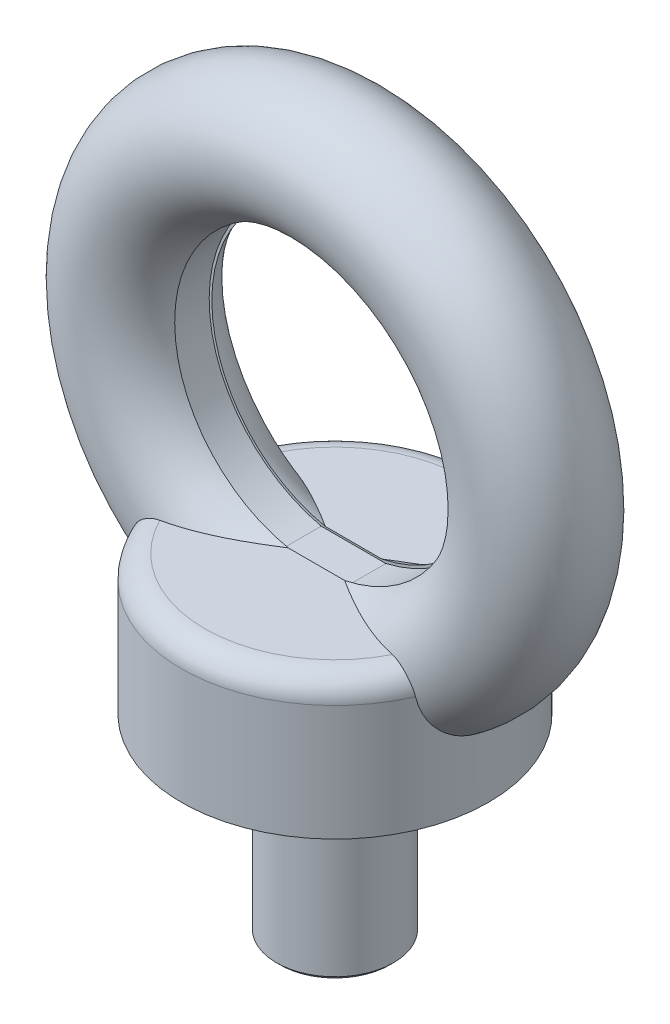
ISO-10303-21;
HEADER;
FILE_DESCRIPTION(('STEP AP214'),'2;1');
FILE_NAME('part.step','',(''),(''),'','','');
FILE_SCHEMA(('AUTOMOTIVE_DESIGN { 1 0 10303 214 1 1 1 1 }'));
ENDSEC;
DATA;
#1=APPLICATION_CONTEXT('core data for automotive mechanical design processes');
#2=APPLICATION_PROTOCOL_DEFINITION('international standard','automotive_design',2000,#1);
#3=PRODUCT_CONTEXT('',#1,'mechanical');
#4=PRODUCT('Part','Part','',(#3));
#5=PRODUCT_RELATED_PRODUCT_CATEGORY('part','',(#4));
#6=PRODUCT_DEFINITION_FORMATION('','',#4);
#7=PRODUCT_DEFINITION_CONTEXT('part definition',#1,'design');
#8=PRODUCT_DEFINITION('design','',#6,#7);
#9=PRODUCT_DEFINITION_SHAPE('','',#8);
#10=(LENGTH_UNIT() NAMED_UNIT(*) SI_UNIT(.MILLI.,.METRE.));
#11=(NAMED_UNIT(*) PLANE_ANGLE_UNIT() SI_UNIT($,.RADIAN.));
#12=(NAMED_UNIT(*) SI_UNIT($,.STERADIAN.) SOLID_ANGLE_UNIT());
#13=UNCERTAINTY_MEASURE_WITH_UNIT(LENGTH_MEASURE(1.E-05),#10,'distance_accuracy_value','');
#14=(GEOMETRIC_REPRESENTATION_CONTEXT(3) GLOBAL_UNCERTAINTY_ASSIGNED_CONTEXT((#13)) GLOBAL_UNIT_ASSIGNED_CONTEXT((#10,
#11,#12)) REPRESENTATION_CONTEXT('',''));
#15=CARTESIAN_POINT('',(0.,0.,0.));
#16=DIRECTION('',(0.,0.,1.));
#17=DIRECTION('',(1.,0.,0.));
#18=AXIS2_PLACEMENT_3D('',#15,#16,#17);
#19=CARTESIAN_POINT('',(0.,-32.,0.));
#20=DIRECTION('',(0.,1.,0.));
#21=DIRECTION('',(0.,0.,1.));
#22=AXIS2_PLACEMENT_3D('',#19,#20,#21);
#23=PLANE('',#22);
#24=CARTESIAN_POINT('',(0.,-32.000000000096,0.));
#25=DIRECTION('',(0.,1.,0.));
#26=DIRECTION('',(0.,0.,1.));
#27=AXIS2_PLACEMENT_3D('',#24,#25,#26);
#28=CIRCLE('',#27,3.75000000008185);
#29=CARTESIAN_POINT('',(3.75000000008185,-32.000000000096,0.));
#30=VERTEX_POINT('',#29);
#31=EDGE_CURVE('E18',#30,#30,#28,.T.);
#32=ORIENTED_EDGE('',*,*,#31,.F.);
#33=EDGE_LOOP('',(#32));
#34=FACE_BOUND('',#33,.T.);
#35=ADVANCED_FACE('F15',(#34),#23,.F.);
#36=CARTESIAN_POINT('',(0.,-31.7499999999313,0.));
#37=DIRECTION('',(0.,1.,0.));
#38=DIRECTION('',(0.,0.,1.));
#39=AXIS2_PLACEMENT_3D('',#36,#37,#38);
#40=CONICAL_SURFACE('',#39,3.99999999979173,0.785398162487954);
#41=CARTESIAN_POINT('',(0.,-31.75,0.));
#42=DIRECTION('',(0.,-1.,0.));
#43=DIRECTION('',(0.,0.,-1.));
#44=AXIS2_PLACEMENT_3D('',#41,#42,#43);
#45=CIRCLE('',#44,4.);
#46=CARTESIAN_POINT('',(3.99999999992429,-31.7499999999372,0.));
#47=VERTEX_POINT('',#46);
#48=EDGE_CURVE('E34',#47,#47,#45,.F.);
#49=ORIENTED_EDGE('',*,*,#48,.F.);
#50=EDGE_LOOP('',(#49));
#51=FACE_BOUND('',#50,.T.);
#52=ORIENTED_EDGE('',*,*,#31,.T.);
#53=EDGE_LOOP('',(#52));
#54=FACE_BOUND('',#53,.T.);
#55=ADVANCED_FACE('F297',(#51,#54),#40,.T.);
#56=CARTESIAN_POINT('',(0.,-19.,0.));
#57=DIRECTION('',(0.,-1.,0.));
#58=DIRECTION('',(0.,0.,-1.));
#59=AXIS2_PLACEMENT_3D('',#56,#57,#58);
#60=CYLINDRICAL_SURFACE('',#59,4.);
#61=ORIENTED_EDGE('',*,*,#48,.T.);
#62=EDGE_LOOP('',(#61));
#63=FACE_BOUND('',#62,.T.);
#64=CARTESIAN_POINT('',(0.,-19.,0.));
#65=DIRECTION('',(0.,-1.,0.));
#66=DIRECTION('',(0.,0.,-1.));
#67=AXIS2_PLACEMENT_3D('',#64,#65,#66);
#68=CIRCLE('',#67,4.);
#69=CARTESIAN_POINT('',(4.,-19.,0.));
#70=VERTEX_POINT('',#69);
#71=EDGE_CURVE('E95',#70,#70,#68,.F.);
#72=ORIENTED_EDGE('',*,*,#71,.F.);
#73=EDGE_LOOP('',(#72));
#74=FACE_BOUND('',#73,.T.);
#75=ADVANCED_FACE('F299',(#63,#74),#60,.T.);
#76=CARTESIAN_POINT('',(0.,0.,0.));
#77=DIRECTION('',(0.,0.,-1.));
#78=DIRECTION('',(-1.,0.,0.));
#79=AXIS2_PLACEMENT_3D('',#76,#77,#78);
#80=CYLINDRICAL_SURFACE('',#79,9.875);
#81=DIRECTION('',(0.,0.,-1.));
#82=VECTOR('',#81,1.);
#83=CARTESIAN_POINT('',(2.20794021658196,-9.62500000000001,0.));
#84=LINE('',#83,#82);
#85=CARTESIAN_POINT('',(2.20794021658194,-9.62500000000001,-1.27));
#86=VERTEX_POINT('',#85);
#87=CARTESIAN_POINT('',(2.20794021658194,-9.62500000000001,1.27));
#88=VERTEX_POINT('',#87);
#89=EDGE_CURVE('E96',#86,#88,#84,.F.);
#90=ORIENTED_EDGE('',*,*,#89,.T.);
#91=CARTESIAN_POINT('',(0.,0.,1.27));
#92=DIRECTION('',(0.,0.,-1.));
#93=DIRECTION('',(-1.,0.,0.));
#94=AXIS2_PLACEMENT_3D('',#91,#92,#93);
#95=CIRCLE('',#94,9.875);
#96=CARTESIAN_POINT('',(-2.20794021658194,-9.62500000000001,1.27));
#97=VERTEX_POINT('',#96);
#98=EDGE_CURVE('E98',#88,#97,#95,.F.);
#99=ORIENTED_EDGE('',*,*,#98,.T.);
#100=DIRECTION('',(0.,0.,-1.));
#101=VECTOR('',#100,1.);
#102=CARTESIAN_POINT('',(-2.20794021658196,-9.62500000000001,0.));
#103=LINE('',#102,#101);
#104=CARTESIAN_POINT('',(-2.20794021658194,-9.62500000000001,-1.27));
#105=VERTEX_POINT('',#104);
#106=EDGE_CURVE('E84',#97,#105,#103,.T.);
#107=ORIENTED_EDGE('',*,*,#106,.T.);
#108=CARTESIAN_POINT('',(0.,0.,-1.27));
#109=DIRECTION('',(0.,0.,-1.));
#110=DIRECTION('',(-1.,0.,0.));
#111=AXIS2_PLACEMENT_3D('',#108,#109,#110);
#112=CIRCLE('',#111,9.875);
#113=EDGE_CURVE('E101',#86,#105,#112,.F.);
#114=ORIENTED_EDGE('',*,*,#113,.F.);
#115=EDGE_LOOP('',(#90,#99,#107,#114));
#116=FACE_BOUND('',#115,.T.);
#117=ADVANCED_FACE('F99',(#116),#80,.F.);
#118=CARTESIAN_POINT('',(-2.20794021658196,-9.62500000000001,0.));
#119=DIRECTION('',(0.,-1.,0.));
#120=DIRECTION('',(0.,0.,-1.));
#121=AXIS2_PLACEMENT_3D('',#118,#119,#120);
#122=PLANE('',#121);
#123=ORIENTED_EDGE('',*,*,#106,.F.);
#124=DIRECTION('',(1.,0.,0.));
#125=VECTOR('',#124,1.);
#126=CARTESIAN_POINT('',(0.,-9.62500000000001,1.27));
#127=LINE('',#126,#125);
#128=EDGE_CURVE('E89',#97,#88,#127,.T.);
#129=ORIENTED_EDGE('',*,*,#128,.T.);
#130=ORIENTED_EDGE('',*,*,#89,.F.);
#131=DIRECTION('',(1.,0.,0.));
#132=VECTOR('',#131,1.);
#133=CARTESIAN_POINT('',(0.,-9.62500000000001,-1.27));
#134=LINE('',#133,#132);
#135=EDGE_CURVE('E92',#105,#86,#134,.T.);
#136=ORIENTED_EDGE('',*,*,#135,.F.);
#137=EDGE_LOOP('',(#123,#129,#130,#136));
#138=FACE_BOUND('',#137,.T.);
#139=ADVANCED_FACE('F86',(#138),#122,.F.);
#140=CARTESIAN_POINT('',(0.,-19.,0.));
#141=DIRECTION('',(0.,-1.,0.));
#142=DIRECTION('',(0.,0.,-1.));
#143=AXIS2_PLACEMENT_3D('',#140,#141,#142);
#144=PLANE('',#143);
#145=ORIENTED_EDGE('',*,*,#71,.T.);
#146=EDGE_LOOP('',(#145));
#147=FACE_BOUND('',#146,.T.);
#148=CARTESIAN_POINT('',(0.,-19.,0.));
#149=DIRECTION('',(0.,-1.,0.));
#150=DIRECTION('',(0.,0.,-1.));
#151=AXIS2_PLACEMENT_3D('',#148,#149,#150);
#152=CIRCLE('',#151,10.5);
#153=CARTESIAN_POINT('',(-10.5,-19.,0.));
#154=VERTEX_POINT('',#153);
#155=EDGE_CURVE('E225',#154,#154,#152,.F.);
#156=ORIENTED_EDGE('',*,*,#155,.F.);
#157=EDGE_LOOP('',(#156));
#158=FACE_BOUND('',#157,.T.);
#159=ADVANCED_FACE('F312',(#147,#158),#144,.T.);
#160=CARTESIAN_POINT('',(0.,-0.877040002481511,1.27));
#161=DIRECTION('',(0.,0.,1.));
#162=DIRECTION('',(1.,0.,0.));
#163=AXIS2_PLACEMENT_3D('',#160,#161,#162);
#164=PLANE('',#163);
#165=CARTESIAN_POINT('',(0.,0.,1.27));
#166=DIRECTION('',(0.,0.,1.));
#167=DIRECTION('',(1.,0.,0.));
#168=AXIS2_PLACEMENT_3D('',#165,#166,#167);
#169=CIRCLE('',#168,9.69418935353239);
#170=CARTESIAN_POINT('',(-1.93062353183149,-9.5,1.26999999996053));
#171=VERTEX_POINT('',#170);
#172=CARTESIAN_POINT('',(1.93062353183149,-9.5,1.26999999996053));
#173=VERTEX_POINT('',#172);
#174=EDGE_CURVE('E210',#171,#173,#169,.F.);
#175=ORIENTED_EDGE('',*,*,#174,.F.);
#176=DIRECTION('',(1.,0.,0.));
#177=VECTOR('',#176,1.);
#178=CARTESIAN_POINT('',(0.,-9.5,1.26999999992106));
#179=LINE('',#178,#177);
#180=EDGE_CURVE('E147',#171,#173,#179,.T.);
#181=ORIENTED_EDGE('',*,*,#180,.T.);
#182=EDGE_LOOP('',(#175,#181));
#183=FACE_BOUND('',#182,.T.);
#184=ORIENTED_EDGE('',*,*,#128,.F.);
#185=ORIENTED_EDGE('',*,*,#98,.F.);
#186=EDGE_LOOP('',(#184,#185));
#187=FACE_BOUND('',#186,.T.);
#188=ADVANCED_FACE('F103',(#183,#187),#164,.F.);
#189=CARTESIAN_POINT('',(0.,-0.877040002481511,-1.27));
#190=DIRECTION('',(0.,0.,1.));
#191=DIRECTION('',(1.,0.,0.));
#192=AXIS2_PLACEMENT_3D('',#189,#190,#191);
#193=PLANE('',#192);
#194=DIRECTION('',(1.,0.,0.));
#195=VECTOR('',#194,1.);
#196=CARTESIAN_POINT('',(0.,-9.5,-1.26999999992106));
#197=LINE('',#196,#195);
#198=CARTESIAN_POINT('',(1.93062353183149,-9.5,-1.26999999996053));
#199=VERTEX_POINT('',#198);
#200=CARTESIAN_POINT('',(-1.93062353183149,-9.5,-1.26999999996053));
#201=VERTEX_POINT('',#200);
#202=EDGE_CURVE('E232',#199,#201,#197,.F.);
#203=ORIENTED_EDGE('',*,*,#202,.T.);
#204=CARTESIAN_POINT('',(0.,0.,-1.27));
#205=DIRECTION('',(0.,0.,1.));
#206=DIRECTION('',(1.,0.,0.));
#207=AXIS2_PLACEMENT_3D('',#204,#205,#206);
#208=CIRCLE('',#207,9.69418935353239);
#209=EDGE_CURVE('E254',#199,#201,#208,.T.);
#210=ORIENTED_EDGE('',*,*,#209,.F.);
#211=EDGE_LOOP('',(#203,#210));
#212=FACE_BOUND('',#211,.T.);
#213=ORIENTED_EDGE('',*,*,#113,.T.);
#214=ORIENTED_EDGE('',*,*,#135,.T.);
#215=EDGE_LOOP('',(#213,#214));
#216=FACE_BOUND('',#215,.T.);
#217=ADVANCED_FACE('F317',(#212,#216),#193,.T.);
#218=CARTESIAN_POINT('',(0.,-9.5,0.));
#219=DIRECTION('',(0.,-1.,0.));
#220=DIRECTION('',(0.,0.,-1.));
#221=AXIS2_PLACEMENT_3D('',#218,#219,#220);
#222=PLANE('',#221);
#223=CARTESIAN_POINT('',(7.9513487411079,-9.5,-4.02600415390766));
#224=CARTESIAN_POINT('',(7.77426963140982,-9.5,-3.98756247792273));
#225=CARTESIAN_POINT('',(7.59817873115079,-9.5,-3.94473743581779));
#226=CARTESIAN_POINT('',(7.2485593516621,-9.5,-3.85120167224825));
#227=CARTESIAN_POINT('',(7.07502566357417,-9.5,-3.80051047022335));
#228=CARTESIAN_POINT('',(6.73042839329768,-9.5,-3.69198742421505));
#229=CARTESIAN_POINT('',(6.55936231907256,-9.5,-3.63416344385591));
#230=CARTESIAN_POINT('',(6.21960369083263,-9.5,-3.51204488138265));
#231=CARTESIAN_POINT('',(6.05091064210426,-9.5,-3.44775167142103));
#232=CARTESIAN_POINT('',(5.71724888491216,-9.5,-3.31389856708));
#233=CARTESIAN_POINT('',(5.55226093712393,-9.5,-3.24438646647425));
#234=CARTESIAN_POINT('',(5.22446991521825,-9.5,-3.10020663315823));
#235=CARTESIAN_POINT('',(5.06166786963588,-9.5,-3.02553656845705));
#236=CARTESIAN_POINT('',(4.73818909903167,-9.5,-2.87161188912956));
#237=CARTESIAN_POINT('',(4.57751305461333,-9.5,-2.79235584801867));
#238=CARTESIAN_POINT('',(4.25823165345901,-9.5,-2.62981787604122));
#239=CARTESIAN_POINT('',(4.09962612346811,-9.5,-2.54653628479975));
#240=CARTESIAN_POINT('',(3.59979324213566,-9.5,-2.27690824406194));
#241=CARTESIAN_POINT('',(3.26210494822447,-9.5,-2.08402463555646));
#242=CARTESIAN_POINT('',(2.59225858877623,-9.5,-1.68536225049192));
#243=CARTESIAN_POINT('',(2.26013363862863,-9.5,-1.47952755642758));
#244=CARTESIAN_POINT('',(1.93062353175026,-9.5,-1.2699999998694));
#245=B_SPLINE_CURVE_WITH_KNOTS('',3,(#223,#224,#225,#226,#227,#228,#229,#230,#231,#232,#233,
#234,#235,#236,#237,#238,#239,#240,#241,#242,#243,#244),.UNSPECIFIED.,.F.,.F.,(4,2,2,2,2,2,2,2,
2,2,4),(0.,0.543503322581538,1.08567892465648,1.62726205258377,2.16873054949225,
2.70573469798466,3.24298324337254,3.78039980972253,4.31777111451569,5.48412750308637,
6.65592064750923),.UNSPECIFIED.);
#246=CARTESIAN_POINT('',(7.9513487411079,-9.5,-4.02600415390766));
#247=VERTEX_POINT('',#246);
#248=EDGE_CURVE('E252',#247,#199,#245,.T.);
#249=ORIENTED_EDGE('',*,*,#248,.F.);
#250=CARTESIAN_POINT('',(0.,-9.5,0.));
#251=DIRECTION('',(0.,-1.,0.));
#252=DIRECTION('',(-0.892156941498783,0.,-0.451725571265937));
#253=AXIS2_PLACEMENT_3D('',#250,#251,#252);
#254=CIRCLE('',#253,8.9125);
#255=CARTESIAN_POINT('',(-7.9513487411079,-9.5,-4.02600415390766));
#256=VERTEX_POINT('',#255);
#257=EDGE_CURVE('E230',#256,#247,#254,.T.);
#258=ORIENTED_EDGE('',*,*,#257,.F.);
#259=CARTESIAN_POINT('',(-1.93062353175027,-9.5,-1.2699999998694));
#260=CARTESIAN_POINT('',(-2.08754631197371,-9.5,-1.36980162375454));
#261=CARTESIAN_POINT('',(-2.24503214338724,-9.5,-1.46873243198837));
#262=CARTESIAN_POINT('',(-2.56089186561598,-9.5,-1.66408825502746));
#263=CARTESIAN_POINT('',(-2.71926163896022,-9.5,-1.76051993420801));
#264=CARTESIAN_POINT('',(-3.03713876651275,-9.5,-1.95044848550183));
#265=CARTESIAN_POINT('',(-3.19664154588332,-9.5,-2.04395299261603));
#266=CARTESIAN_POINT('',(-3.51703272276256,-9.5,-2.22758916870737));
#267=CARTESIAN_POINT('',(-3.67791646835831,-9.5,-2.31772893721635));
#268=CARTESIAN_POINT('',(-4.00132317056332,-9.5,-2.49419108926024));
#269=CARTESIAN_POINT('',(-4.16384189511633,-9.5,-2.58052121055377));
#270=CARTESIAN_POINT('',(-4.49077964156292,-9.5,-2.74890577179906));
#271=CARTESIAN_POINT('',(-4.65519548633682,-9.5,-2.83096636534168));
#272=CARTESIAN_POINT('',(-4.98675598422368,-9.5,-2.99060051162638));
#273=CARTESIAN_POINT('',(-5.15390691106692,-9.5,-3.06816106947477));
#274=CARTESIAN_POINT('',(-5.49061288831372,-9.5,-3.21794722186607));
#275=CARTESIAN_POINT('',(-5.66016822132656,-9.5,-3.29017218297319));
#276=CARTESIAN_POINT('',(-6.00189552402462,-9.5,-3.42869645935955));
#277=CARTESIAN_POINT('',(-6.17407002441795,-9.5,-3.49498955317415));
#278=CARTESIAN_POINT('',(-6.52126391164362,-9.5,-3.62101149929799));
#279=CARTESIAN_POINT('',(-6.6962889624734,-9.5,-3.68072479739974));
#280=CARTESIAN_POINT('',(-7.04944414187317,-9.5,-3.79288678858337));
#281=CARTESIAN_POINT('',(-7.22758394416269,-9.5,-3.84530522261255));
#282=CARTESIAN_POINT('',(-7.58723841641442,-9.5,-3.94207199833537));
#283=CARTESIAN_POINT('',(-7.7687672682436,-9.5,-3.98636749070313));
#284=CARTESIAN_POINT('',(-7.95134874110791,-9.5,-4.02600415390766));
#285=B_SPLINE_CURVE_WITH_KNOTS('',3,(#259,#260,#261,#262,#263,#264,#265,#266,#267,#268,#269,
#270,#271,#272,#273,#274,#275,#276,#277,#278,#279,#280,#281,#282,#283,#284),.UNSPECIFIED.,.F.,
.F.,(4,2,2,2,2,2,2,2,2,2,2,2,4),(0.,0.557921096010694,1.11415751365786,1.66879603703007,
2.22199975182574,2.77402261536739,3.32522646914338,3.87795003386041,4.43073911217067,
4.98410133279853,5.53874480511595,6.09562441408643,6.65600772441404),.UNSPECIFIED.);
#286=EDGE_CURVE('E175',#201,#256,#285,.T.);
#287=ORIENTED_EDGE('',*,*,#286,.F.);
#288=ORIENTED_EDGE('',*,*,#202,.F.);
#289=EDGE_LOOP('',(#249,#258,#287,#288));
#290=FACE_BOUND('',#289,.T.);
#291=ADVANCED_FACE('F157',(#290),#222,.F.);
#292=CARTESIAN_POINT('',(0.,-11.0875,0.));
#293=DIRECTION('',(0.,-1.,0.));
#294=DIRECTION('',(0.,0.,-1.));
#295=AXIS2_PLACEMENT_3D('',#292,#293,#294);
#296=TOROIDAL_SURFACE('',#295,8.91250000000001,1.5875);
#297=CARTESIAN_POINT('',(9.64807510074433,-11.0874999957977,-4.14302387760408));
#298=CARTESIAN_POINT('',(9.64445769789736,-11.0418561751411,-4.15144402068093));
#299=CARTESIAN_POINT('',(9.63879743001377,-10.9963575091574,-4.15960780416379));
#300=CARTESIAN_POINT('',(9.623550812963,-10.9059118968888,-4.17521023224506));
#301=CARTESIAN_POINT('',(9.61396579385729,-10.8609647690025,-4.18264912144712));
#302=CARTESIAN_POINT('',(9.57960605951506,-10.7274864343238,-4.20353866089209));
#303=CARTESIAN_POINT('',(9.54920984900103,-10.6401213874514,-4.21559989835874));
#304=CARTESIAN_POINT('',(9.47488926181832,-10.4709079494251,-4.23466514671791));
#305=CARTESIAN_POINT('',(9.43097532149524,-10.3890553615963,-4.24167304513094));
#306=CARTESIAN_POINT('',(9.33104345543921,-10.2327538149956,-4.24984626618132));
#307=CARTESIAN_POINT('',(9.2750238662765,-10.1583058757469,-4.25101078535039));
#308=CARTESIAN_POINT('',(9.15117502728964,-10.0174047934862,-4.24716070750764));
#309=CARTESIAN_POINT('',(9.08312666165472,-9.95114748134784,-4.24201858253305));
#310=CARTESIAN_POINT('',(8.93785910412215,-9.83048206460857,-4.22566133372415));
#311=CARTESIAN_POINT('',(8.86063966859108,-9.77607427490421,-4.21444604852555));
#312=CARTESIAN_POINT('',(8.69963115060783,-9.68124473022324,-4.18705528779658));
#313=CARTESIAN_POINT('',(8.61589401662701,-9.64072399082316,-4.17091653611169));
#314=CARTESIAN_POINT('',(8.44345163235096,-9.57448963704373,-4.13527789545852));
#315=CARTESIAN_POINT('',(8.35474961821371,-9.5487664979774,-4.11578017906333));
#316=CARTESIAN_POINT('',(8.2130761256209,-9.52055759010703,-4.08416267050926));
#317=CARTESIAN_POINT('',(8.16100121654907,-9.51284016202147,-4.07244299888052));
#318=CARTESIAN_POINT('',(8.05642555610206,-9.5025625682513,-4.04907000036398));
#319=CARTESIAN_POINT('',(8.0039256978402,-9.49999349893469,-4.03741659375213));
#320=CARTESIAN_POINT('',(7.9513487411079,-9.5,-4.02600415390766));
#321=B_SPLINE_CURVE_WITH_KNOTS('',3,(#297,#298,#299,#300,#301,#302,#303,#304,#305,#306,#307,
#308,#309,#310,#311,#312,#313,#314,#315,#316,#317,#318,#319,#320),.UNSPECIFIED.,.F.,.F.,(4,2,2,
2,2,2,2,2,2,2,2,4),(0.,0.139563490505869,0.279079723343215,0.557516563696675,0.835738974132054,
1.11399963927455,1.39798103428568,1.68196997507263,1.96389040839304,2.24562917597111,
2.4072025006827,2.5684961566141),.UNSPECIFIED.);
#322=CARTESIAN_POINT('',(9.64807510091072,-11.0874999847841,-4.14302387721659));
#323=VERTEX_POINT('',#322);
#324=EDGE_CURVE('E247',#323,#247,#321,.T.);
#325=ORIENTED_EDGE('',*,*,#324,.F.);
#326=CARTESIAN_POINT('',(0.,-11.0874999737705,0.));
#327=DIRECTION('',(0.,-1.,0.));
#328=DIRECTION('',(0.,0.,-1.));
#329=AXIS2_PLACEMENT_3D('',#326,#327,#328);
#330=CIRCLE('',#329,10.5);
#331=CARTESIAN_POINT('',(-9.64807509825387,-11.087499977465,-4.14302388340375));
#332=VERTEX_POINT('',#331);
#333=EDGE_CURVE('E228',#332,#323,#330,.T.);
#334=ORIENTED_EDGE('',*,*,#333,.F.);
#335=CARTESIAN_POINT('',(-7.9513487411079,-9.5,-4.02600415390766));
#336=CARTESIAN_POINT('',(-7.99749082900566,-9.4999926050418,-4.03602012238849));
#337=CARTESIAN_POINT('',(-8.04359041312341,-9.5019725081142,-4.04622507523822));
#338=CARTESIAN_POINT('',(-8.13543048009467,-9.50988853288595,-4.06671202526468));
#339=CARTESIAN_POINT('',(-8.1811709696301,-9.51582458079318,-4.07699402100083));
#340=CARTESIAN_POINT('',(-8.27199063845926,-9.53162932308622,-4.09732784372282));
#341=CARTESIAN_POINT('',(-8.31707023266038,-9.54149543004416,-4.10737981755272));
#342=CARTESIAN_POINT('',(-8.40630899598492,-9.56507737358415,-4.12697394554823));
#343=CARTESIAN_POINT('',(-8.45046819444039,-9.5787930872811,-4.13651611597594));
#344=CARTESIAN_POINT('',(-8.58124125070726,-9.62560010322376,-4.1639900125819));
#345=CARTESIAN_POINT('',(-8.66615176037778,-9.66435148950587,-4.18076940179846));
#346=CARTESIAN_POINT('',(-8.82904001449954,-9.75557458061028,-4.20946357762714));
#347=CARTESIAN_POINT('',(-8.90702073722982,-9.80804035268562,-4.22138046202985));
#348=CARTESIAN_POINT('',(-9.05366838755774,-9.9246009087517,-4.23923000137627));
#349=CARTESIAN_POINT('',(-9.122393841521,-9.98861598285247,-4.24520195129151));
#350=CARTESIAN_POINT('',(-9.24937612762581,-10.1266074888581,-4.25089141130713));
#351=CARTESIAN_POINT('',(-9.30762654896153,-10.2005899727847,-4.25060510434864));
#352=CARTESIAN_POINT('',(-9.41234366539559,-10.3569524102614,-4.24396504503475));
#353=CARTESIAN_POINT('',(-9.45872664031041,-10.4393865725051,-4.23756961477394));
#354=CARTESIAN_POINT('',(-9.53760404347008,-10.6100344489708,-4.21943952584465));
#355=CARTESIAN_POINT('',(-9.57011613971523,-10.6982406448126,-4.2077116988976));
#356=CARTESIAN_POINT('',(-9.60853254114128,-10.8372889927011,-4.18649196797806));
#357=CARTESIAN_POINT('',(-9.61981558887651,-10.8869147193252,-4.17840204948216));
#358=CARTESIAN_POINT('',(-9.63758547663741,-10.9868019132379,-4.16132050776901));
#359=CARTESIAN_POINT('',(-9.6440778622085,-11.0370625767433,-4.15232994086062));
#360=CARTESIAN_POINT('',(-9.64807509958506,-11.0874999811594,-4.14302388030373));
#361=B_SPLINE_CURVE_WITH_KNOTS('',3,(#335,#336,#337,#338,#339,#340,#341,#342,#343,#344,#345,
#346,#347,#348,#349,#350,#351,#352,#353,#354,#355,#356,#357,#358,#359,#360),.UNSPECIFIED.,.F.,
.F.,(4,2,2,2,2,2,2,2,2,2,2,2,4),(0.,0.141605197575412,0.28320775392885,0.42471723726791,
0.566222203930542,0.849228462658154,1.13211249689244,1.41311404899681,1.69428699537243,
1.97739197402879,2.26013526388664,2.41451976391789,2.56872527091634),.UNSPECIFIED.);
#362=EDGE_CURVE('E173',#256,#332,#361,.T.);
#363=ORIENTED_EDGE('',*,*,#362,.F.);
#364=ORIENTED_EDGE('',*,*,#257,.T.);
#365=EDGE_LOOP('',(#325,#334,#363,#364));
#366=FACE_BOUND('',#365,.T.);
#367=ADVANCED_FACE('F153',(#366),#296,.T.);
#368=CARTESIAN_POINT('',(0.,-9.5,0.));
#369=DIRECTION('',(0.,-1.,0.));
#370=DIRECTION('',(0.,0.,-1.));
#371=AXIS2_PLACEMENT_3D('',#368,#369,#370);
#372=CYLINDRICAL_SURFACE('',#371,10.5);
#373=ORIENTED_EDGE('',*,*,#155,.T.);
#374=EDGE_LOOP('',(#373));
#375=FACE_BOUND('',#374,.T.);
#376=CARTESIAN_POINT('',(0.,-11.0874999737705,0.));
#377=DIRECTION('',(0.,-1.,0.));
#378=DIRECTION('',(0.,0.,-1.));
#379=AXIS2_PLACEMENT_3D('',#376,#377,#378);
#380=CIRCLE('',#379,10.5);
#381=CARTESIAN_POINT('',(-9.64807510091072,-11.0874999847841,4.14302387721659));
#382=VERTEX_POINT('',#381);
#383=CARTESIAN_POINT('',(9.64807509825387,-11.087499977465,4.14302388340376));
#384=VERTEX_POINT('',#383);
#385=EDGE_CURVE('E203',#382,#384,#380,.F.);
#386=ORIENTED_EDGE('',*,*,#385,.F.);
#387=CARTESIAN_POINT('',(-9.64807509958506,-11.0874999811594,-4.14302388030373));
#388=CARTESIAN_POINT('',(-9.65461549278002,-11.1701456818462,-4.12778492858993));
#389=CARTESIAN_POINT('',(-9.66189203790399,-11.2524131843892,-4.1107476470517));
#390=CARTESIAN_POINT('',(-9.67791470537175,-11.4160215736431,-4.07288694724268));
#391=CARTESIAN_POINT('',(-9.68666242909872,-11.4973613463676,-4.05205940120544));
#392=CARTESIAN_POINT('',(-9.70561315046534,-11.6587856996774,-4.00645459601666));
#393=CARTESIAN_POINT('',(-9.71581657801865,-11.7388699016719,-3.98167616979474));
#394=CARTESIAN_POINT('',(-9.73765931322789,-11.897714055601,-3.92795566515776));
#395=CARTESIAN_POINT('',(-9.74930297213072,-11.9764691353065,-3.89900092316965));
#396=CARTESIAN_POINT('',(-9.77391332507569,-12.1320695649417,-3.83689110121257));
#397=CARTESIAN_POINT('',(-9.7868795987626,-12.2089155120384,-3.80373735497238));
#398=CARTESIAN_POINT('',(-9.81401408374504,-12.3603932231304,-3.73316962649279));
#399=CARTESIAN_POINT('',(-9.82818216562881,-12.4350252243601,-3.69575610280188));
#400=CARTESIAN_POINT('',(-9.86505488789359,-12.6191454395112,-3.59649178646774));
#401=CARTESIAN_POINT('',(-9.88843372111874,-12.7270380934162,-3.5318961010752));
#402=CARTESIAN_POINT('',(-9.93692332835508,-12.9360395819393,-3.39307450242203));
#403=CARTESIAN_POINT('',(-9.96203432252995,-13.0371475509664,-3.31884736390985));
#404=CARTESIAN_POINT('',(-10.0131346999281,-13.2314056127395,-3.16132412897517));
#405=CARTESIAN_POINT('',(-10.0391219634384,-13.3245732214732,-3.07804896721651));
#406=CARTESIAN_POINT('',(-10.0911654096111,-13.5023861215665,-2.90288158579186));
#407=CARTESIAN_POINT('',(-10.1172215844936,-13.5870323360898,-2.81099030163964));
#408=CARTESIAN_POINT('',(-10.1659903577102,-13.7392405268192,-2.62880832550719));
#409=CARTESIAN_POINT('',(-10.1887790354973,-13.8076641408025,-2.53925575332839));
#410=CARTESIAN_POINT('',(-10.2330868668497,-13.9367122825532,-2.35435161409741));
#411=CARTESIAN_POINT('',(-10.2546055835279,-13.9973341347581,-2.25899807406454));
#412=CARTESIAN_POINT('',(-10.2957915015954,-14.1104758182562,-2.06317494936481));
#413=CARTESIAN_POINT('',(-10.3154580365072,-14.1629927374297,-1.96270354300344));
#414=CARTESIAN_POINT('',(-10.3524179427039,-14.259697893662,-1.75736399789809));
#415=CARTESIAN_POINT('',(-10.3697104210724,-14.3038829993283,-1.6524942241202));
#416=CARTESIAN_POINT('',(-10.40136442891,-14.3834850390364,-1.43982691851832));
#417=CARTESIAN_POINT('',(-10.4157438922876,-14.4189559288201,-1.33205223746092));
#418=CARTESIAN_POINT('',(-10.4413531152915,-14.4813909833035,-1.1136591963968));
#419=CARTESIAN_POINT('',(-10.4525817356154,-14.5083520714117,-1.00303982352981));
#420=CARTESIAN_POINT('',(-10.4716001730296,-14.5536607815102,-0.779826256187441));
#421=CARTESIAN_POINT('',(-10.479391920542,-14.5720132391629,-0.667233207334288));
#422=CARTESIAN_POINT('',(-10.4913586882862,-14.6000843170538,-0.440746442321083));
#423=CARTESIAN_POINT('',(-10.4955324416128,-14.6097999129713,-0.326852284687729));
#424=CARTESIAN_POINT('',(-10.5001965226895,-14.6206523612046,-0.0966673438280923));
#425=CARTESIAN_POINT('',(-10.5006240157567,-14.6216428722058,0.0196316409426587));
#426=CARTESIAN_POINT('',(-10.4976203136457,-14.6146596372669,0.251910405018258));
#427=CARTESIAN_POINT('',(-10.4941890979927,-14.606685843761,0.367890182626075));
#428=CARTESIAN_POINT('',(-10.4835517651736,-14.5817903312691,0.598747432549477));
#429=CARTESIAN_POINT('',(-10.4763444883108,-14.564865863354,0.71362455517631));
#430=CARTESIAN_POINT('',(-10.4583384226846,-14.52211996326,0.941383425919574));
#431=CARTESIAN_POINT('',(-10.4475409115765,-14.4963016959969,1.05426586885327));
#432=CARTESIAN_POINT('',(-10.422586288463,-14.4357401792977,1.27764124666855));
#433=CARTESIAN_POINT('',(-10.4084180864988,-14.4009674368084,1.38812495150963));
#434=CARTESIAN_POINT('',(-10.3771159243169,-14.3226660526116,1.60546417971619));
#435=CARTESIAN_POINT('',(-10.3599830995368,-14.2791407620605,1.71232107346097));
#436=CARTESIAN_POINT('',(-10.3231965832986,-14.1834704227788,1.92169574119947));
#437=CARTESIAN_POINT('',(-10.3035421018684,-14.1313226713616,2.02421214198224));
#438=CARTESIAN_POINT('',(-10.2622576172976,-14.0186592609459,2.22406773491263));
#439=CARTESIAN_POINT('',(-10.240628404721,-13.9581469456737,2.32140897440346));
#440=CARTESIAN_POINT('',(-10.196261762848,-13.8298315314534,2.50906943425092));
#441=CARTESIAN_POINT('',(-10.1735412998184,-13.7621276007265,2.59946047595036));
#442=CARTESIAN_POINT('',(-10.1273810675037,-13.6192268600368,2.77385796212182));
#443=CARTESIAN_POINT('',(-10.1039415665578,-13.5440328223366,2.85786674867093));
#444=CARTESIAN_POINT('',(-10.0569867905537,-13.3866217417651,3.01894937729883));
#445=CARTESIAN_POINT('',(-10.0334715401965,-13.3044068014764,3.09602528150126));
#446=CARTESIAN_POINT('',(-9.98699747453781,-13.1335036471642,3.24280903009911));
#447=CARTESIAN_POINT('',(-9.96403864451138,-13.0448156046937,3.31251706964106));
#448=CARTESIAN_POINT('',(-9.91957435513446,-12.8628385868936,3.44336443102796));
#449=CARTESIAN_POINT('',(-9.89805370014983,-12.7696258910623,3.50460480526753));
#450=CARTESIAN_POINT('',(-9.85665021361754,-12.5782455088328,3.6194160598138));
#451=CARTESIAN_POINT('',(-9.83676745929885,-12.4800775891414,3.67298657856538));
#452=CARTESIAN_POINT('',(-9.79905249274215,-12.2794940050586,3.77245328856038));
#453=CARTESIAN_POINT('',(-9.7812213460478,-12.1770761706242,3.81834549748824));
#454=CARTESIAN_POINT('',(-9.7479357329177,-11.9688266412299,3.90253682170387));
#455=CARTESIAN_POINT('',(-9.73248077054402,-11.8629956642269,3.94083752191364));
#456=CARTESIAN_POINT('',(-9.7038717957605,-11.6465714677529,4.01077867469118));
#457=CARTESIAN_POINT('',(-9.69076797581484,-11.53592575161,4.04227624113996));
#458=CARTESIAN_POINT('',(-9.66734204562256,-11.3129128172606,4.09796803320565));
#459=CARTESIAN_POINT('',(-9.65701078753237,-11.2005525860348,4.12218630880532));
#460=CARTESIAN_POINT('',(-9.64807510074433,-11.0874999957977,4.14302387760409));
#461=B_SPLINE_CURVE_WITH_KNOTS('',3,(#387,#388,#389,#390,#391,#392,#393,#394,#395,#396,#397,
#398,#399,#400,#401,#402,#403,#404,#405,#406,#407,#408,#409,#410,#411,#412,#413,#414,#415,#416,
#417,#418,#419,#420,#421,#422,#423,#424,#425,#426,#427,#428,#429,#430,#431,#432,#433,#434,#435,
#436,#437,#438,#439,#440,#441,#442,#443,#444,#445,#446,#447,#448,#449,#450,#451,#452,#453,#454,
#455,#456,#457,#458,#459,#460),.UNSPECIFIED.,.F.,.F.,(4,2,2,2,2,2,2,2,2,2,2,2,2,2,2,2,2,2,2,2,2,
2,2,2,2,2,2,2,2,2,2,2,2,2,2,2,4),(0.,0.252872914027865,0.506022884090763,0.759247772408061,
1.01325730248021,1.26718635295492,1.52108809475223,1.9042359414094,2.28743257754616,
2.66976075700218,3.05204747232997,3.39658118736334,3.74123274486846,4.08600784954799,
4.43091227585152,4.77362405817368,5.11645960126414,5.4591023345708,5.80186500191795,
6.15036592315267,6.49886869359075,6.84747855833178,7.19596449594055,7.54561324706383,
7.89512837945967,8.24475327481282,8.59423880996687,8.93941227442805,9.28445845355619,
9.62940166005123,9.97433572803031,10.3147119877128,10.6551042873694,10.9956725861126,
11.3361697074284,11.683241632432,12.0291539360288),.UNSPECIFIED.);
#462=EDGE_CURVE('E275',#332,#382,#461,.T.);
#463=ORIENTED_EDGE('',*,*,#462,.F.);
#464=ORIENTED_EDGE('',*,*,#333,.T.);
#465=CARTESIAN_POINT('',(9.64807509958506,-11.0874999811594,4.14302388030373));
#466=CARTESIAN_POINT('',(9.65461549278003,-11.1701456818462,4.12778492858993));
#467=CARTESIAN_POINT('',(9.66189203790399,-11.2524131843892,4.1107476470517));
#468=CARTESIAN_POINT('',(9.67791470537175,-11.4160215736431,4.07288694724268));
#469=CARTESIAN_POINT('',(9.68666242909872,-11.4973613463676,4.05205940120544));
#470=CARTESIAN_POINT('',(9.70561315046534,-11.6587856996774,4.00645459601666));
#471=CARTESIAN_POINT('',(9.71581657801865,-11.7388699016719,3.98167616979474));
#472=CARTESIAN_POINT('',(9.73765931322789,-11.897714055601,3.92795566515775));
#473=CARTESIAN_POINT('',(9.74930297213072,-11.9764691353065,3.89900092316965));
#474=CARTESIAN_POINT('',(9.77391332507569,-12.1320695649417,3.83689110121257));
#475=CARTESIAN_POINT('',(9.7868795987626,-12.2089155120384,3.80373735497238));
#476=CARTESIAN_POINT('',(9.81401408374504,-12.3603932231304,3.73316962649279));
#477=CARTESIAN_POINT('',(9.8281821656288,-12.4350252243601,3.69575610280188));
#478=CARTESIAN_POINT('',(9.86505488789357,-12.6191454395112,3.59649178646774));
#479=CARTESIAN_POINT('',(9.88843372111874,-12.7270380934162,3.5318961010752));
#480=CARTESIAN_POINT('',(9.93692332835508,-12.9360395819393,3.39307450242203));
#481=CARTESIAN_POINT('',(9.96203432252995,-13.0371475509664,3.31884736390985));
#482=CARTESIAN_POINT('',(10.0131346999281,-13.2314056127395,3.16132412897517));
#483=CARTESIAN_POINT('',(10.0391219634384,-13.3245732214732,3.07804896721651));
#484=CARTESIAN_POINT('',(10.0911654096111,-13.5023861215665,2.90288158579186));
#485=CARTESIAN_POINT('',(10.1172215844936,-13.5870323360898,2.81099030163964));
#486=CARTESIAN_POINT('',(10.1659903577103,-13.7392405268191,2.62880832550719));
#487=CARTESIAN_POINT('',(10.1887790354973,-13.8076641408025,2.53925575332839));
#488=CARTESIAN_POINT('',(10.2330868668497,-13.9367122825532,2.35435161409741));
#489=CARTESIAN_POINT('',(10.2546055835279,-13.9973341347581,2.25899807406454));
#490=CARTESIAN_POINT('',(10.2957915015954,-14.1104758182562,2.06317494936481));
#491=CARTESIAN_POINT('',(10.3154580365072,-14.1629927374297,1.96270354300345));
#492=CARTESIAN_POINT('',(10.3524179427039,-14.259697893662,1.7573639978981));
#493=CARTESIAN_POINT('',(10.3697104210724,-14.3038829993283,1.65249422412021));
#494=CARTESIAN_POINT('',(10.40136442891,-14.3834850390364,1.43982691851832));
#495=CARTESIAN_POINT('',(10.4157438922876,-14.4189559288201,1.33205223746093));
#496=CARTESIAN_POINT('',(10.4413531152915,-14.4813909833035,1.11365919639681));
#497=CARTESIAN_POINT('',(10.4525817356154,-14.5083520714117,1.00303982352982));
#498=CARTESIAN_POINT('',(10.4716001730296,-14.5536607815101,0.77982625618745));
#499=CARTESIAN_POINT('',(10.479391920542,-14.5720132391629,0.667233207334297));
#500=CARTESIAN_POINT('',(10.4913586882862,-14.6000843170538,0.440746442321092));
#501=CARTESIAN_POINT('',(10.4955324416128,-14.6097999129713,0.326852284687739));
#502=CARTESIAN_POINT('',(10.5001965226895,-14.6206523612046,0.0966673438281017));
#503=CARTESIAN_POINT('',(10.5006240157567,-14.6216428722058,-0.0196316409426493));
#504=CARTESIAN_POINT('',(10.4976203136457,-14.6146596372669,-0.251910405018248));
#505=CARTESIAN_POINT('',(10.4941890979927,-14.606685843761,-0.367890182626065));
#506=CARTESIAN_POINT('',(10.4835517651736,-14.5817903312691,-0.598747432549467));
#507=CARTESIAN_POINT('',(10.4763444883108,-14.564865863354,-0.7136245551763));
#508=CARTESIAN_POINT('',(10.4583384226846,-14.52211996326,-0.941383425919564));
#509=CARTESIAN_POINT('',(10.4475409115765,-14.4963016959969,-1.05426586885326));
#510=CARTESIAN_POINT('',(10.422586288463,-14.4357401792978,-1.27764124666855));
#511=CARTESIAN_POINT('',(10.4084180864988,-14.4009674368085,-1.38812495150962));
#512=CARTESIAN_POINT('',(10.3771159243169,-14.3226660526116,-1.60546417971618));
#513=CARTESIAN_POINT('',(10.3599830995369,-14.2791407620605,-1.71232107346095));
#514=CARTESIAN_POINT('',(10.3231965832986,-14.1834704227788,-1.92169574119946));
#515=CARTESIAN_POINT('',(10.3035421018684,-14.1313226713616,-2.02421214198223));
#516=CARTESIAN_POINT('',(10.2622576172976,-14.0186592609459,-2.22406773491262));
#517=CARTESIAN_POINT('',(10.240628404721,-13.9581469456737,-2.32140897440345));
#518=CARTESIAN_POINT('',(10.196261762848,-13.8298315314534,-2.50906943425091));
#519=CARTESIAN_POINT('',(10.1735412998184,-13.7621276007265,-2.59946047595035));
#520=CARTESIAN_POINT('',(10.1273810675037,-13.6192268600368,-2.77385796212181));
#521=CARTESIAN_POINT('',(10.1039415665578,-13.5440328223366,-2.85786674867092));
#522=CARTESIAN_POINT('',(10.0569867905537,-13.3866217417651,-3.01894937729883));
#523=CARTESIAN_POINT('',(10.0334715401965,-13.3044068014764,-3.09602528150125));
#524=CARTESIAN_POINT('',(9.98699747453781,-13.1335036471642,-3.2428090300991));
#525=CARTESIAN_POINT('',(9.96403864451138,-13.0448156046937,-3.31251706964106));
#526=CARTESIAN_POINT('',(9.91957435513446,-12.8628385868936,-3.44336443102795));
#527=CARTESIAN_POINT('',(9.89805370014984,-12.7696258910623,-3.50460480526753));
#528=CARTESIAN_POINT('',(9.85665021361754,-12.5782455088328,-3.61941605981379));
#529=CARTESIAN_POINT('',(9.83676745929885,-12.4800775891414,-3.67298657856538));
#530=CARTESIAN_POINT('',(9.79905249274215,-12.2794940050586,-3.77245328856037));
#531=CARTESIAN_POINT('',(9.7812213460478,-12.1770761706242,-3.81834549748824));
#532=CARTESIAN_POINT('',(9.7479357329177,-11.9688266412299,-3.90253682170387));
#533=CARTESIAN_POINT('',(9.73248077054402,-11.8629956642269,-3.94083752191363));
#534=CARTESIAN_POINT('',(9.7038717957605,-11.6465714677529,-4.01077867469118));
#535=CARTESIAN_POINT('',(9.69076797581483,-11.53592575161,-4.04227624113996));
#536=CARTESIAN_POINT('',(9.66734204562256,-11.3129128172606,-4.09796803320565));
#537=CARTESIAN_POINT('',(9.65701078753237,-11.2005525860348,-4.12218630880532));
#538=CARTESIAN_POINT('',(9.64807510074433,-11.0874999957977,-4.14302387760408));
#539=B_SPLINE_CURVE_WITH_KNOTS('',3,(#465,#466,#467,#468,#469,#470,#471,#472,#473,#474,#475,
#476,#477,#478,#479,#480,#481,#482,#483,#484,#485,#486,#487,#488,#489,#490,#491,#492,#493,#494,
#495,#496,#497,#498,#499,#500,#501,#502,#503,#504,#505,#506,#507,#508,#509,#510,#511,#512,#513,
#514,#515,#516,#517,#518,#519,#520,#521,#522,#523,#524,#525,#526,#527,#528,#529,#530,#531,#532,
#533,#534,#535,#536,#537,#538),.UNSPECIFIED.,.F.,.F.,(4,2,2,2,2,2,2,2,2,2,2,2,2,2,2,2,2,2,2,2,2,
2,2,2,2,2,2,2,2,2,2,2,2,2,2,2,4),(0.,0.252872914027866,0.506022884090762,0.759247772408063,
1.01325730248021,1.26718635295492,1.52108809475223,1.9042359414094,2.28743257754616,
2.66976075700218,3.05204747232997,3.39658118736333,3.74123274486845,4.08600784954797,
4.43091227585151,4.77362405817367,5.11645960126413,5.45910233457079,5.80186500191794,
6.15036592315266,6.49886869359074,6.84747855833177,7.19596449594054,7.54561324706382,
7.89512837945966,8.2447532748128,8.59423880996685,8.93941227442804,9.28445845355618,
9.62940166005122,9.9743357280303,10.3147119877128,10.6551042873694,10.9956725861126,
11.3361697074284,11.683241632432,12.0291539360287),.UNSPECIFIED.);
#540=EDGE_CURVE('E208',#384,#323,#539,.T.);
#541=ORIENTED_EDGE('',*,*,#540,.F.);
#542=EDGE_LOOP('',(#386,#463,#464,#541));
#543=FACE_BOUND('',#542,.T.);
#544=ADVANCED_FACE('F136',(#375,#543),#372,.T.);
#545=CARTESIAN_POINT('',(0.,-11.0875,0.));
#546=DIRECTION('',(0.,-1.,0.));
#547=DIRECTION('',(0.,0.,-1.));
#548=AXIS2_PLACEMENT_3D('',#545,#546,#547);
#549=TOROIDAL_SURFACE('',#548,8.91250000000001,1.5875);
#550=CARTESIAN_POINT('',(-9.64807510074433,-11.0874999957977,4.14302387760408));
#551=CARTESIAN_POINT('',(-9.64445769789736,-11.0418561751411,4.15144402068093));
#552=CARTESIAN_POINT('',(-9.63879743001378,-10.9963575091574,4.15960780416379));
#553=CARTESIAN_POINT('',(-9.623550812963,-10.9059118968888,4.17521023224506));
#554=CARTESIAN_POINT('',(-9.61396579385729,-10.8609647690025,4.18264912144712));
#555=CARTESIAN_POINT('',(-9.57960605951506,-10.7274864343238,4.20353866089209));
#556=CARTESIAN_POINT('',(-9.54920984900103,-10.6401213874514,4.21559989835874));
#557=CARTESIAN_POINT('',(-9.47488926181832,-10.470907949425,4.23466514671792));
#558=CARTESIAN_POINT('',(-9.43097532149524,-10.3890553615963,4.24167304513094));
#559=CARTESIAN_POINT('',(-9.3310434554392,-10.2327538149956,4.24984626618132));
#560=CARTESIAN_POINT('',(-9.2750238662765,-10.1583058757469,4.25101078535039));
#561=CARTESIAN_POINT('',(-9.15117502728964,-10.0174047934862,4.24716070750764));
#562=CARTESIAN_POINT('',(-9.08312666165472,-9.95114748134784,4.24201858253305));
#563=CARTESIAN_POINT('',(-8.93785910412215,-9.83048206460857,4.22566133372415));
#564=CARTESIAN_POINT('',(-8.86063966859108,-9.77607427490421,4.21444604852555));
#565=CARTESIAN_POINT('',(-8.69963115060783,-9.68124473022324,4.18705528779658));
#566=CARTESIAN_POINT('',(-8.61589401662701,-9.64072399082316,4.17091653611169));
#567=CARTESIAN_POINT('',(-8.44345163235096,-9.57448963704373,4.13527789545851));
#568=CARTESIAN_POINT('',(-8.3547496182137,-9.5487664979774,4.11578017906333));
#569=CARTESIAN_POINT('',(-8.2130761256209,-9.52055759010703,4.08416267050926));
#570=CARTESIAN_POINT('',(-8.16100121654907,-9.51284016202147,4.07244299888052));
#571=CARTESIAN_POINT('',(-8.05642555610206,-9.5025625682513,4.04907000036398));
#572=CARTESIAN_POINT('',(-8.0039256978402,-9.49999349893469,4.03741659375213));
#573=CARTESIAN_POINT('',(-7.9513487411079,-9.5,4.02600415390766));
#574=B_SPLINE_CURVE_WITH_KNOTS('',3,(#550,#551,#552,#553,#554,#555,#556,#557,#558,#559,#560,
#561,#562,#563,#564,#565,#566,#567,#568,#569,#570,#571,#572,#573),.UNSPECIFIED.,.F.,.F.,(4,2,2,
2,2,2,2,2,2,2,2,4),(0.,0.139563490505871,0.279079723343214,0.557516563696677,0.835738974132057,
1.11399963927455,1.39798103428568,1.68196997507263,1.96389040839305,2.24562917597112,
2.4072025006827,2.5684961566141),.UNSPECIFIED.);
#575=CARTESIAN_POINT('',(-7.9513487411079,-9.5,4.02600415390766));
#576=VERTEX_POINT('',#575);
#577=EDGE_CURVE('E23',#382,#576,#574,.T.);
#578=ORIENTED_EDGE('',*,*,#577,.F.);
#579=ORIENTED_EDGE('',*,*,#385,.T.);
#580=CARTESIAN_POINT('',(7.9513487411079,-9.5,4.02600415390766));
#581=CARTESIAN_POINT('',(7.99749082900565,-9.4999926050418,4.03602012238849));
#582=CARTESIAN_POINT('',(8.04359041312341,-9.5019725081142,4.04622507523822));
#583=CARTESIAN_POINT('',(8.13543048009467,-9.50988853288595,4.06671202526468));
#584=CARTESIAN_POINT('',(8.1811709696301,-9.51582458079317,4.07699402100083));
#585=CARTESIAN_POINT('',(8.27199063845925,-9.53162932308622,4.09732784372281));
#586=CARTESIAN_POINT('',(8.31707023266037,-9.54149543004416,4.10737981755272));
#587=CARTESIAN_POINT('',(8.40630899598492,-9.56507737358415,4.12697394554823));
#588=CARTESIAN_POINT('',(8.45046819444039,-9.5787930872811,4.13651611597594));
#589=CARTESIAN_POINT('',(8.58124125070725,-9.62560010322376,4.1639900125819));
#590=CARTESIAN_POINT('',(8.66615176037778,-9.66435148950587,4.18076940179846));
#591=CARTESIAN_POINT('',(8.82904001449953,-9.75557458061028,4.20946357762714));
#592=CARTESIAN_POINT('',(8.90702073722982,-9.80804035268562,4.22138046202984));
#593=CARTESIAN_POINT('',(9.05366838755774,-9.9246009087517,4.23923000137627));
#594=CARTESIAN_POINT('',(9.122393841521,-9.98861598285247,4.24520195129151));
#595=CARTESIAN_POINT('',(9.24937612762581,-10.1266074888581,4.25089141130713));
#596=CARTESIAN_POINT('',(9.30762654896153,-10.2005899727847,4.25060510434864));
#597=CARTESIAN_POINT('',(9.41234366539559,-10.3569524102614,4.24396504503475));
#598=CARTESIAN_POINT('',(9.45872664031041,-10.4393865725051,4.23756961477394));
#599=CARTESIAN_POINT('',(9.53760404347008,-10.6100344489708,4.21943952584466));
#600=CARTESIAN_POINT('',(9.57011613971522,-10.6982406448126,4.2077116988976));
#601=CARTESIAN_POINT('',(9.60853254114128,-10.8372889927011,4.18649196797806));
#602=CARTESIAN_POINT('',(9.61981558887651,-10.8869147193252,4.17840204948216));
#603=CARTESIAN_POINT('',(9.63758547663741,-10.9868019132379,4.16132050776901));
#604=CARTESIAN_POINT('',(9.6440778622085,-11.0370625767433,4.15232994086062));
#605=CARTESIAN_POINT('',(9.64807509958506,-11.0874999811594,4.14302388030373));
#606=B_SPLINE_CURVE_WITH_KNOTS('',3,(#580,#581,#582,#583,#584,#585,#586,#587,#588,#589,#590,
#591,#592,#593,#594,#595,#596,#597,#598,#599,#600,#601,#602,#603,#604,#605),.UNSPECIFIED.,.F.,
.F.,(4,2,2,2,2,2,2,2,2,2,2,2,4),(0.,0.141605197575412,0.28320775392885,0.424717237267909,
0.566222203930541,0.849228462658153,1.13211249689244,1.41311404899681,1.69428699537243,
1.97739197402879,2.26013526388664,2.41451976391789,2.56872527091635),.UNSPECIFIED.);
#607=CARTESIAN_POINT('',(7.9513487411079,-9.5,4.02600415390766));
#608=VERTEX_POINT('',#607);
#609=EDGE_CURVE('E205',#608,#384,#606,.T.);
#610=ORIENTED_EDGE('',*,*,#609,.F.);
#611=CARTESIAN_POINT('',(0.,-9.5,0.));
#612=DIRECTION('',(0.,-1.,0.));
#613=DIRECTION('',(0.892156941498783,0.,0.451725571265938));
#614=AXIS2_PLACEMENT_3D('',#611,#612,#613);
#615=CIRCLE('',#614,8.9125);
#616=EDGE_CURVE('E116',#608,#576,#615,.T.);
#617=ORIENTED_EDGE('',*,*,#616,.T.);
#618=EDGE_LOOP('',(#578,#579,#610,#617));
#619=FACE_BOUND('',#618,.T.);
#620=ADVANCED_FACE('F124',(#619),#549,.T.);
#621=CARTESIAN_POINT('',(0.,-9.5,0.));
#622=DIRECTION('',(0.,-1.,0.));
#623=DIRECTION('',(0.,0.,-1.));
#624=AXIS2_PLACEMENT_3D('',#621,#622,#623);
#625=PLANE('',#624);
#626=CARTESIAN_POINT('',(-7.95134874110791,-9.5,4.02600415390766));
#627=CARTESIAN_POINT('',(-7.77426963140982,-9.5,3.98756247792273));
#628=CARTESIAN_POINT('',(-7.5981787311508,-9.5,3.94473743581779));
#629=CARTESIAN_POINT('',(-7.2485593516621,-9.5,3.85120167224825));
#630=CARTESIAN_POINT('',(-7.07502566357418,-9.5,3.80051047022335));
#631=CARTESIAN_POINT('',(-6.73042839329768,-9.5,3.69198742421505));
#632=CARTESIAN_POINT('',(-6.55936231907257,-9.5,3.63416344385591));
#633=CARTESIAN_POINT('',(-6.21960369083264,-9.5,3.51204488138266));
#634=CARTESIAN_POINT('',(-6.05091064210426,-9.5,3.44775167142104));
#635=CARTESIAN_POINT('',(-5.71724888491217,-9.5,3.31389856708));
#636=CARTESIAN_POINT('',(-5.55226093712394,-9.5,3.24438646647425));
#637=CARTESIAN_POINT('',(-5.22446991521826,-9.5,3.10020663315823));
#638=CARTESIAN_POINT('',(-5.06166786963589,-9.5,3.02553656845705));
#639=CARTESIAN_POINT('',(-4.73818909903168,-9.5,2.87161188912956));
#640=CARTESIAN_POINT('',(-4.57751305461334,-9.5,2.79235584801867));
#641=CARTESIAN_POINT('',(-4.25823165345901,-9.5,2.62981787604122));
#642=CARTESIAN_POINT('',(-4.09962612346812,-9.5,2.54653628479975));
#643=CARTESIAN_POINT('',(-3.59979324213566,-9.5,2.27690824406194));
#644=CARTESIAN_POINT('',(-3.26210494822448,-9.5,2.08402463555646));
#645=CARTESIAN_POINT('',(-2.59225858877624,-9.5,1.68536225049193));
#646=CARTESIAN_POINT('',(-2.26013363862864,-9.5,1.47952755642758));
#647=CARTESIAN_POINT('',(-1.93062353175027,-9.5,1.2699999998694));
#648=B_SPLINE_CURVE_WITH_KNOTS('',3,(#626,#627,#628,#629,#630,#631,#632,#633,#634,#635,#636,
#637,#638,#639,#640,#641,#642,#643,#644,#645,#646,#647),.UNSPECIFIED.,.F.,.F.,(4,2,2,2,2,2,2,2,
2,2,4),(0.,0.543503322581538,1.08567892465648,1.62726205258377,2.16873054949225,
2.70573469798466,3.24298324337254,3.78039980972253,4.3177711145157,5.48412750308637,
6.65592064750923),.UNSPECIFIED.);
#649=EDGE_CURVE('E9',#576,#171,#648,.T.);
#650=ORIENTED_EDGE('',*,*,#649,.F.);
#651=ORIENTED_EDGE('',*,*,#616,.F.);
#652=CARTESIAN_POINT('',(1.93062353175027,-9.5,1.2699999998694));
#653=CARTESIAN_POINT('',(2.08754631197371,-9.5,1.36980162375454));
#654=CARTESIAN_POINT('',(2.24503214338723,-9.5,1.46873243198836));
#655=CARTESIAN_POINT('',(2.56089186561598,-9.5,1.66408825502746));
#656=CARTESIAN_POINT('',(2.71926163896022,-9.5,1.76051993420801));
#657=CARTESIAN_POINT('',(3.03713876651275,-9.5,1.95044848550183));
#658=CARTESIAN_POINT('',(3.19664154588332,-9.5,2.04395299261603));
#659=CARTESIAN_POINT('',(3.51703272276256,-9.5,2.22758916870737));
#660=CARTESIAN_POINT('',(3.67791646835831,-9.5,2.31772893721635));
#661=CARTESIAN_POINT('',(4.00132317056331,-9.5,2.49419108926024));
#662=CARTESIAN_POINT('',(4.16384189511633,-9.5,2.58052121055377));
#663=CARTESIAN_POINT('',(4.49077964156292,-9.5,2.74890577179906));
#664=CARTESIAN_POINT('',(4.65519548633681,-9.5,2.83096636534168));
#665=CARTESIAN_POINT('',(4.98675598422368,-9.5,2.99060051162638));
#666=CARTESIAN_POINT('',(5.15390691106692,-9.5,3.06816106947476));
#667=CARTESIAN_POINT('',(5.49061288831372,-9.5,3.21794722186607));
#668=CARTESIAN_POINT('',(5.66016822132656,-9.5,3.29017218297319));
#669=CARTESIAN_POINT('',(6.00189552402461,-9.5,3.42869645935955));
#670=CARTESIAN_POINT('',(6.17407002441795,-9.5,3.49498955317415));
#671=CARTESIAN_POINT('',(6.52126391164361,-9.5,3.62101149929799));
#672=CARTESIAN_POINT('',(6.6962889624734,-9.5,3.68072479739974));
#673=CARTESIAN_POINT('',(7.04944414187317,-9.5,3.79288678858337));
#674=CARTESIAN_POINT('',(7.22758394416269,-9.5,3.84530522261255));
#675=CARTESIAN_POINT('',(7.58723841641441,-9.5,3.94207199833537));
#676=CARTESIAN_POINT('',(7.7687672682436,-9.5,3.98636749070313));
#677=CARTESIAN_POINT('',(7.9513487411079,-9.5,4.02600415390766));
#678=B_SPLINE_CURVE_WITH_KNOTS('',3,(#652,#653,#654,#655,#656,#657,#658,#659,#660,#661,#662,
#663,#664,#665,#666,#667,#668,#669,#670,#671,#672,#673,#674,#675,#676,#677),.UNSPECIFIED.,.F.,
.F.,(4,2,2,2,2,2,2,2,2,2,2,2,4),(0.,0.557921096010694,1.11415751365786,1.66879603703007,
2.22199975182574,2.77402261536739,3.32522646914338,3.87795003386041,4.43073911217067,
4.98410133279853,5.53874480511595,6.09562441408643,6.65600772441404),.UNSPECIFIED.);
#679=EDGE_CURVE('E198',#173,#608,#678,.T.);
#680=ORIENTED_EDGE('',*,*,#679,.F.);
#681=ORIENTED_EDGE('',*,*,#180,.F.);
#682=EDGE_LOOP('',(#650,#651,#680,#681));
#683=FACE_BOUND('',#682,.T.);
#684=ADVANCED_FACE('F135',(#683),#625,.F.);
#685=CARTESIAN_POINT('',(0.,0.,0.));
#686=DIRECTION('',(0.,0.,1.));
#687=DIRECTION('',(1.,0.,0.));
#688=AXIS2_PLACEMENT_3D('',#685,#686,#687);
#689=TOROIDAL_SURFACE('',#688,13.75,4.24999999999999);
#690=ORIENTED_EDGE('',*,*,#577,.T.);
#691=ORIENTED_EDGE('',*,*,#649,.T.);
#692=ORIENTED_EDGE('',*,*,#174,.T.);
#693=ORIENTED_EDGE('',*,*,#679,.T.);
#694=ORIENTED_EDGE('',*,*,#609,.T.);
#695=ORIENTED_EDGE('',*,*,#540,.T.);
#696=ORIENTED_EDGE('',*,*,#324,.T.);
#697=ORIENTED_EDGE('',*,*,#248,.T.);
#698=ORIENTED_EDGE('',*,*,#209,.T.);
#699=ORIENTED_EDGE('',*,*,#286,.T.);
#700=ORIENTED_EDGE('',*,*,#362,.T.);
#701=ORIENTED_EDGE('',*,*,#462,.T.);
#702=EDGE_LOOP('',(#690,#691,#692,#693,#694,#695,#696,#697,#698,#699,#700,#701));
#703=FACE_BOUND('',#702,.T.);
#704=ADVANCED_FACE('F177',(#703),#689,.T.);
#705=CLOSED_SHELL('',(#35,#55,#75,#117,#139,#159,#188,#217,#291,#367,#544,#620,#684,#704));
#706=MANIFOLD_SOLID_BREP('B1',#705);
#707=ADVANCED_BREP_SHAPE_REPRESENTATION('',(#18,#706),#14);
#708=SHAPE_DEFINITION_REPRESENTATION(#9,#707);
ENDSEC;
END-ISO-10303-21;
